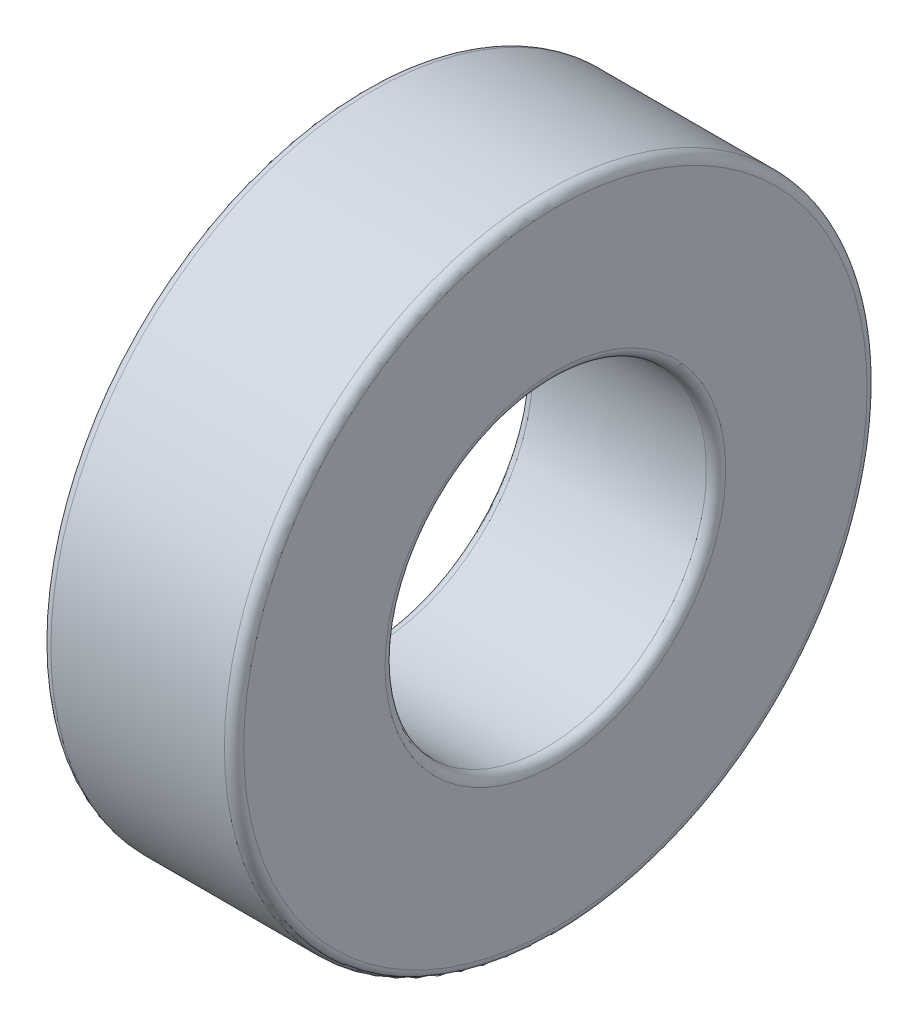
ISO-10303-21;
HEADER;
FILE_DESCRIPTION(('STEP AP214'),'2;1');
FILE_NAME('part.step','',(''),(''),'','','');
FILE_SCHEMA(('AUTOMOTIVE_DESIGN { 1 0 10303 214 1 1 1 1 }'));
ENDSEC;
DATA;
#1=APPLICATION_CONTEXT('core data for automotive mechanical design processes');
#2=APPLICATION_PROTOCOL_DEFINITION('international standard','automotive_design',2000,#1);
#3=PRODUCT_CONTEXT('',#1,'mechanical');
#4=PRODUCT('Part','Part','',(#3));
#5=PRODUCT_RELATED_PRODUCT_CATEGORY('part','',(#4));
#6=PRODUCT_DEFINITION_FORMATION('','',#4);
#7=PRODUCT_DEFINITION_CONTEXT('part definition',#1,'design');
#8=PRODUCT_DEFINITION('design','',#6,#7);
#9=PRODUCT_DEFINITION_SHAPE('','',#8);
#10=(LENGTH_UNIT() NAMED_UNIT(*) SI_UNIT(.MILLI.,.METRE.));
#11=(NAMED_UNIT(*) PLANE_ANGLE_UNIT() SI_UNIT($,.RADIAN.));
#12=(NAMED_UNIT(*) SI_UNIT($,.STERADIAN.) SOLID_ANGLE_UNIT());
#13=UNCERTAINTY_MEASURE_WITH_UNIT(LENGTH_MEASURE(1.E-05),#10,'distance_accuracy_value','');
#14=(GEOMETRIC_REPRESENTATION_CONTEXT(3) GLOBAL_UNCERTAINTY_ASSIGNED_CONTEXT((#13)) GLOBAL_UNIT_ASSIGNED_CONTEXT((#10,
#11,#12)) REPRESENTATION_CONTEXT('',''));
#15=CARTESIAN_POINT('',(0.,0.,0.));
#16=DIRECTION('',(0.,0.,1.));
#17=DIRECTION('',(1.,0.,0.));
#18=AXIS2_PLACEMENT_3D('',#15,#16,#17);
#19=CARTESIAN_POINT('',(0.15,0.,0.));
#20=DIRECTION('',(-1.,0.,0.));
#21=DIRECTION('',(0.,0.,1.));
#22=AXIS2_PLACEMENT_3D('',#19,#20,#21);
#23=CYLINDRICAL_SURFACE('',#22,2.5);
#24=CARTESIAN_POINT('',(2.85,0.,0.));
#25=DIRECTION('',(-1.,0.,0.));
#26=DIRECTION('',(0.,0.,1.));
#27=AXIS2_PLACEMENT_3D('',#24,#25,#26);
#28=CIRCLE('',#27,2.5);
#29=CARTESIAN_POINT('',(2.85,0.,2.5));
#30=VERTEX_POINT('',#29);
#31=EDGE_CURVE('E10',#30,#30,#28,.T.);
#32=ORIENTED_EDGE('',*,*,#31,.F.);
#33=EDGE_LOOP('',(#32));
#34=FACE_BOUND('',#33,.T.);
#35=CARTESIAN_POINT('',(0.15,0.,0.));
#36=DIRECTION('',(-1.,0.,0.));
#37=DIRECTION('',(0.,0.,1.));
#38=AXIS2_PLACEMENT_3D('',#35,#36,#37);
#39=CIRCLE('',#38,2.5);
#40=CARTESIAN_POINT('',(0.15,0.,2.5));
#41=VERTEX_POINT('',#40);
#42=EDGE_CURVE('E82',#41,#41,#39,.T.);
#43=ORIENTED_EDGE('',*,*,#42,.T.);
#44=EDGE_LOOP('',(#43));
#45=FACE_BOUND('',#44,.T.);
#46=ADVANCED_FACE('F15',(#34,#45),#23,.F.);
#47=CARTESIAN_POINT('',(2.85,0.,0.));
#48=DIRECTION('',(-1.,0.,0.));
#49=DIRECTION('',(0.,0.,1.));
#50=AXIS2_PLACEMENT_3D('',#47,#48,#49);
#51=TOROIDAL_SURFACE('',#50,2.65,0.15);
#52=CARTESIAN_POINT('',(3.,0.,0.));
#53=DIRECTION('',(-1.,0.,0.));
#54=DIRECTION('',(0.,0.,1.));
#55=AXIS2_PLACEMENT_3D('',#52,#53,#54);
#56=CIRCLE('',#55,2.65);
#57=CARTESIAN_POINT('',(3.,0.,2.65));
#58=VERTEX_POINT('',#57);
#59=EDGE_CURVE('E24',#58,#58,#56,.T.);
#60=ORIENTED_EDGE('',*,*,#59,.F.);
#61=EDGE_LOOP('',(#60));
#62=FACE_BOUND('',#61,.T.);
#63=ORIENTED_EDGE('',*,*,#31,.T.);
#64=EDGE_LOOP('',(#63));
#65=FACE_BOUND('',#64,.T.);
#66=ADVANCED_FACE('F110',(#62,#65),#51,.T.);
#67=CARTESIAN_POINT('',(3.,2.65,0.));
#68=DIRECTION('',(-1.,0.,0.));
#69=DIRECTION('',(0.,0.,1.));
#70=AXIS2_PLACEMENT_3D('',#67,#68,#69);
#71=PLANE('',#70);
#72=CARTESIAN_POINT('',(3.,0.,0.));
#73=DIRECTION('',(-1.,0.,0.));
#74=DIRECTION('',(0.,0.,1.));
#75=AXIS2_PLACEMENT_3D('',#72,#73,#74);
#76=CIRCLE('',#75,4.85);
#77=CARTESIAN_POINT('',(3.,0.,4.85));
#78=VERTEX_POINT('',#77);
#79=EDGE_CURVE('E33',#78,#78,#76,.T.);
#80=ORIENTED_EDGE('',*,*,#79,.F.);
#81=EDGE_LOOP('',(#80));
#82=FACE_BOUND('',#81,.T.);
#83=ORIENTED_EDGE('',*,*,#59,.T.);
#84=EDGE_LOOP('',(#83));
#85=FACE_BOUND('',#84,.T.);
#86=ADVANCED_FACE('F107',(#82,#85),#71,.F.);
#87=CARTESIAN_POINT('',(2.85,0.,0.));
#88=DIRECTION('',(-1.,0.,0.));
#89=DIRECTION('',(0.,0.,1.));
#90=AXIS2_PLACEMENT_3D('',#87,#88,#89);
#91=TOROIDAL_SURFACE('',#90,4.85,0.15);
#92=CARTESIAN_POINT('',(2.85,0.,0.));
#93=DIRECTION('',(-1.,0.,0.));
#94=DIRECTION('',(0.,0.,1.));
#95=AXIS2_PLACEMENT_3D('',#92,#93,#94);
#96=CIRCLE('',#95,5.);
#97=CARTESIAN_POINT('',(2.85,0.,5.));
#98=VERTEX_POINT('',#97);
#99=EDGE_CURVE('E97',#98,#98,#96,.T.);
#100=ORIENTED_EDGE('',*,*,#99,.F.);
#101=EDGE_LOOP('',(#100));
#102=FACE_BOUND('',#101,.T.);
#103=ORIENTED_EDGE('',*,*,#79,.T.);
#104=EDGE_LOOP('',(#103));
#105=FACE_BOUND('',#104,.T.);
#106=ADVANCED_FACE('F105',(#102,#105),#91,.T.);
#107=CARTESIAN_POINT('',(0.15,0.,0.));
#108=DIRECTION('',(-1.,0.,0.));
#109=DIRECTION('',(0.,0.,1.));
#110=AXIS2_PLACEMENT_3D('',#107,#108,#109);
#111=CYLINDRICAL_SURFACE('',#110,5.);
#112=CARTESIAN_POINT('',(0.15,0.,0.));
#113=DIRECTION('',(-1.,0.,0.));
#114=DIRECTION('',(0.,0.,1.));
#115=AXIS2_PLACEMENT_3D('',#112,#113,#114);
#116=CIRCLE('',#115,5.);
#117=CARTESIAN_POINT('',(0.15,0.,5.));
#118=VERTEX_POINT('',#117);
#119=EDGE_CURVE('E93',#118,#118,#116,.T.);
#120=ORIENTED_EDGE('',*,*,#119,.F.);
#121=EDGE_LOOP('',(#120));
#122=FACE_BOUND('',#121,.T.);
#123=ORIENTED_EDGE('',*,*,#99,.T.);
#124=EDGE_LOOP('',(#123));
#125=FACE_BOUND('',#124,.T.);
#126=ADVANCED_FACE('F123',(#122,#125),#111,.T.);
#127=CARTESIAN_POINT('',(0.15,0.,0.));
#128=DIRECTION('',(-1.,0.,0.));
#129=DIRECTION('',(0.,0.,1.));
#130=AXIS2_PLACEMENT_3D('',#127,#128,#129);
#131=TOROIDAL_SURFACE('',#130,4.85,0.15);
#132=CARTESIAN_POINT('',(0.,0.,0.));
#133=DIRECTION('',(-1.,0.,0.));
#134=DIRECTION('',(0.,0.,1.));
#135=AXIS2_PLACEMENT_3D('',#132,#133,#134);
#136=CIRCLE('',#135,4.85);
#137=CARTESIAN_POINT('',(0.,0.,4.85));
#138=VERTEX_POINT('',#137);
#139=EDGE_CURVE('E89',#138,#138,#136,.T.);
#140=ORIENTED_EDGE('',*,*,#139,.F.);
#141=EDGE_LOOP('',(#140));
#142=FACE_BOUND('',#141,.T.);
#143=ORIENTED_EDGE('',*,*,#119,.T.);
#144=EDGE_LOOP('',(#143));
#145=FACE_BOUND('',#144,.T.);
#146=ADVANCED_FACE('F127',(#142,#145),#131,.T.);
#147=CARTESIAN_POINT('',(0.,2.65,0.));
#148=DIRECTION('',(-1.,0.,0.));
#149=DIRECTION('',(0.,0.,1.));
#150=AXIS2_PLACEMENT_3D('',#147,#148,#149);
#151=PLANE('',#150);
#152=ORIENTED_EDGE('',*,*,#139,.T.);
#153=EDGE_LOOP('',(#152));
#154=FACE_BOUND('',#153,.T.);
#155=CARTESIAN_POINT('',(0.,0.,0.));
#156=DIRECTION('',(-1.,0.,0.));
#157=DIRECTION('',(0.,0.,1.));
#158=AXIS2_PLACEMENT_3D('',#155,#156,#157);
#159=CIRCLE('',#158,2.65);
#160=CARTESIAN_POINT('',(0.,0.,2.65));
#161=VERTEX_POINT('',#160);
#162=EDGE_CURVE('E85',#161,#161,#159,.T.);
#163=ORIENTED_EDGE('',*,*,#162,.F.);
#164=EDGE_LOOP('',(#163));
#165=FACE_BOUND('',#164,.T.);
#166=ADVANCED_FACE('F131',(#154,#165),#151,.T.);
#167=CARTESIAN_POINT('',(0.15,0.,0.));
#168=DIRECTION('',(-1.,0.,0.));
#169=DIRECTION('',(0.,0.,1.));
#170=AXIS2_PLACEMENT_3D('',#167,#168,#169);
#171=TOROIDAL_SURFACE('',#170,2.65,0.15);
#172=ORIENTED_EDGE('',*,*,#42,.F.);
#173=EDGE_LOOP('',(#172));
#174=FACE_BOUND('',#173,.T.);
#175=ORIENTED_EDGE('',*,*,#162,.T.);
#176=EDGE_LOOP('',(#175));
#177=FACE_BOUND('',#176,.T.);
#178=ADVANCED_FACE('F135',(#174,#177),#171,.T.);
#179=CLOSED_SHELL('',(#46,#66,#86,#106,#126,#146,#166,#178));
#180=CARTESIAN_POINT('',(0.5625,0.,0.));
#181=DIRECTION('',(-1.,0.,0.));
#182=DIRECTION('',(0.,0.,-1.));
#183=AXIS2_PLACEMENT_3D('',#180,#181,#182);
#184=CYLINDRICAL_SURFACE('',#183,3.6825);
#185=CARTESIAN_POINT('',(1.4325,0.,0.));
#186=DIRECTION('',(-1.,0.,0.));
#187=DIRECTION('',(0.,-1.,0.));
#188=AXIS2_PLACEMENT_3D('',#185,#186,#187);
#189=CIRCLE('',#188,3.6825);
#190=CARTESIAN_POINT('',(1.4325,-3.6825,0.));
#191=VERTEX_POINT('',#190);
#192=EDGE_CURVE('E63',#191,#191,#189,.T.);
#193=ORIENTED_EDGE('',*,*,#192,.T.);
#194=EDGE_LOOP('',(#193));
#195=FACE_BOUND('',#194,.T.);
#196=CARTESIAN_POINT('',(0.5625,0.,0.));
#197=DIRECTION('',(-1.,0.,0.));
#198=DIRECTION('',(0.,0.,-1.));
#199=AXIS2_PLACEMENT_3D('',#196,#197,#198);
#200=CIRCLE('',#199,3.6825);
#201=CARTESIAN_POINT('',(0.5625,0.,-3.6825));
#202=VERTEX_POINT('',#201);
#203=EDGE_CURVE('E78',#202,#202,#200,.T.);
#204=ORIENTED_EDGE('',*,*,#203,.F.);
#205=EDGE_LOOP('',(#204));
#206=FACE_BOUND('',#205,.T.);
#207=ADVANCED_FACE('F146',(#195,#206),#184,.T.);
#208=CARTESIAN_POINT('',(0.5625,0.,0.));
#209=DIRECTION('',(-1.,0.,0.));
#210=DIRECTION('',(0.,0.,-1.));
#211=AXIS2_PLACEMENT_3D('',#208,#209,#210);
#212=CYLINDRICAL_SURFACE('',#211,3.8175);
#213=CARTESIAN_POINT('',(1.4325,0.,0.));
#214=DIRECTION('',(-1.,0.,0.));
#215=DIRECTION('',(0.,-1.,0.));
#216=AXIS2_PLACEMENT_3D('',#213,#214,#215);
#217=CIRCLE('',#216,3.8175);
#218=CARTESIAN_POINT('',(1.4325,-3.8175,0.));
#219=VERTEX_POINT('',#218);
#220=EDGE_CURVE('E18',#219,#219,#217,.F.);
#221=ORIENTED_EDGE('',*,*,#220,.T.);
#222=EDGE_LOOP('',(#221));
#223=FACE_BOUND('',#222,.T.);
#224=CARTESIAN_POINT('',(0.5625,0.,0.));
#225=DIRECTION('',(-1.,0.,0.));
#226=DIRECTION('',(0.,0.,-1.));
#227=AXIS2_PLACEMENT_3D('',#224,#225,#226);
#228=CIRCLE('',#227,3.8175);
#229=CARTESIAN_POINT('',(0.5625,0.,-3.8175));
#230=VERTEX_POINT('',#229);
#231=EDGE_CURVE('E74',#230,#230,#228,.T.);
#232=ORIENTED_EDGE('',*,*,#231,.T.);
#233=EDGE_LOOP('',(#232));
#234=FACE_BOUND('',#233,.T.);
#235=ADVANCED_FACE('F152',(#223,#234),#212,.F.);
#236=CARTESIAN_POINT('',(0.5625,-3.6825,0.));
#237=DIRECTION('',(-1.,0.,0.));
#238=DIRECTION('',(0.,0.,-1.));
#239=AXIS2_PLACEMENT_3D('',#236,#237,#238);
#240=PLANE('',#239);
#241=ORIENTED_EDGE('',*,*,#231,.F.);
#242=EDGE_LOOP('',(#241));
#243=FACE_BOUND('',#242,.T.);
#244=ORIENTED_EDGE('',*,*,#203,.T.);
#245=EDGE_LOOP('',(#244));
#246=FACE_BOUND('',#245,.T.);
#247=ADVANCED_FACE('F148',(#243,#246),#240,.F.);
#248=CARTESIAN_POINT('',(1.4325,-3.33333333333333,0.));
#249=DIRECTION('',(-1.,0.,0.));
#250=DIRECTION('',(0.,0.,-1.));
#251=AXIS2_PLACEMENT_3D('',#248,#249,#250);
#252=PLANE('',#251);
#253=CARTESIAN_POINT('',(1.4325,0.,0.));
#254=DIRECTION('',(-1.,0.,0.));
#255=DIRECTION('',(0.,0.,-1.));
#256=AXIS2_PLACEMENT_3D('',#253,#254,#255);
#257=CIRCLE('',#256,4.16666666666667);
#258=CARTESIAN_POINT('',(1.4325,0.,-4.16666666666667));
#259=VERTEX_POINT('',#258);
#260=EDGE_CURVE('E50',#259,#259,#257,.T.);
#261=ORIENTED_EDGE('',*,*,#260,.F.);
#262=EDGE_LOOP('',(#261));
#263=FACE_BOUND('',#262,.T.);
#264=ORIENTED_EDGE('',*,*,#220,.F.);
#265=EDGE_LOOP('',(#264));
#266=FACE_BOUND('',#265,.T.);
#267=ADVANCED_FACE('F151',(#263,#266),#252,.F.);
#268=CARTESIAN_POINT('',(1.4325,0.,0.));
#269=DIRECTION('',(-1.,0.,0.));
#270=DIRECTION('',(0.,0.,-1.));
#271=AXIS2_PLACEMENT_3D('',#268,#269,#270);
#272=CYLINDRICAL_SURFACE('',#271,4.16666666666667);
#273=CARTESIAN_POINT('',(1.5675,0.,0.));
#274=DIRECTION('',(-1.,0.,0.));
#275=DIRECTION('',(0.,0.,-1.));
#276=AXIS2_PLACEMENT_3D('',#273,#274,#275);
#277=CIRCLE('',#276,4.16666666666667);
#278=CARTESIAN_POINT('',(1.5675,0.,-4.16666666666667));
#279=VERTEX_POINT('',#278);
#280=EDGE_CURVE('E59',#279,#279,#277,.T.);
#281=ORIENTED_EDGE('',*,*,#280,.F.);
#282=EDGE_LOOP('',(#281));
#283=FACE_BOUND('',#282,.T.);
#284=ORIENTED_EDGE('',*,*,#260,.T.);
#285=EDGE_LOOP('',(#284));
#286=FACE_BOUND('',#285,.T.);
#287=ADVANCED_FACE('F168',(#283,#286),#272,.F.);
#288=CARTESIAN_POINT('',(1.5675,-4.16666666666667,0.));
#289=DIRECTION('',(1.,0.,0.));
#290=DIRECTION('',(0.,0.,1.));
#291=AXIS2_PLACEMENT_3D('',#288,#289,#290);
#292=PLANE('',#291);
#293=ORIENTED_EDGE('',*,*,#280,.T.);
#294=EDGE_LOOP('',(#293));
#295=FACE_BOUND('',#294,.T.);
#296=CARTESIAN_POINT('',(1.5675,0.,0.));
#297=DIRECTION('',(1.,0.,0.));
#298=DIRECTION('',(0.,1.,0.));
#299=AXIS2_PLACEMENT_3D('',#296,#297,#298);
#300=CIRCLE('',#299,3.8175);
#301=CARTESIAN_POINT('',(1.5675,3.8175,0.));
#302=VERTEX_POINT('',#301);
#303=EDGE_CURVE('E36',#302,#302,#300,.F.);
#304=ORIENTED_EDGE('',*,*,#303,.F.);
#305=EDGE_LOOP('',(#304));
#306=FACE_BOUND('',#305,.T.);
#307=ADVANCED_FACE('F167',(#295,#306),#292,.F.);
#308=CARTESIAN_POINT('',(1.4325,0.,0.));
#309=DIRECTION('',(-1.,0.,0.));
#310=DIRECTION('',(0.,0.,-1.));
#311=AXIS2_PLACEMENT_3D('',#308,#309,#310);
#312=CIRCLE('',#311,3.33333333333333);
#313=CARTESIAN_POINT('',(1.4325,0.,-3.33333333333333));
#314=VERTEX_POINT('',#313);
#315=EDGE_CURVE('E40',#314,#314,#312,.T.);
#316=ORIENTED_EDGE('',*,*,#315,.T.);
#317=EDGE_LOOP('',(#316));
#318=FACE_BOUND('',#317,.T.);
#319=ORIENTED_EDGE('',*,*,#192,.F.);
#320=EDGE_LOOP('',(#319));
#321=FACE_BOUND('',#320,.T.);
#322=ADVANCED_FACE('F164',(#318,#321),#252,.F.);
#323=CARTESIAN_POINT('',(1.5675,0.,0.));
#324=DIRECTION('',(-1.,0.,0.));
#325=DIRECTION('',(0.,0.,-1.));
#326=AXIS2_PLACEMENT_3D('',#323,#324,#325);
#327=CIRCLE('',#326,3.33333333333333);
#328=CARTESIAN_POINT('',(1.5675,0.,-3.33333333333333));
#329=VERTEX_POINT('',#328);
#330=EDGE_CURVE('E208',#329,#329,#327,.T.);
#331=ORIENTED_EDGE('',*,*,#330,.F.);
#332=EDGE_LOOP('',(#331));
#333=FACE_BOUND('',#332,.T.);
#334=CARTESIAN_POINT('',(1.5675,0.,0.));
#335=DIRECTION('',(1.,0.,0.));
#336=DIRECTION('',(0.,1.,0.));
#337=AXIS2_PLACEMENT_3D('',#334,#335,#336);
#338=CIRCLE('',#337,3.6825);
#339=CARTESIAN_POINT('',(1.5675,3.6825,0.));
#340=VERTEX_POINT('',#339);
#341=EDGE_CURVE('E39',#340,#340,#338,.T.);
#342=ORIENTED_EDGE('',*,*,#341,.F.);
#343=EDGE_LOOP('',(#342));
#344=FACE_BOUND('',#343,.T.);
#345=ADVANCED_FACE('F162',(#333,#344),#292,.F.);
#346=CARTESIAN_POINT('',(1.4325,0.,0.));
#347=DIRECTION('',(-1.,0.,0.));
#348=DIRECTION('',(0.,0.,-1.));
#349=AXIS2_PLACEMENT_3D('',#346,#347,#348);
#350=CYLINDRICAL_SURFACE('',#349,3.33333333333333);
#351=ORIENTED_EDGE('',*,*,#315,.F.);
#352=EDGE_LOOP('',(#351));
#353=FACE_BOUND('',#352,.T.);
#354=ORIENTED_EDGE('',*,*,#330,.T.);
#355=EDGE_LOOP('',(#354));
#356=FACE_BOUND('',#355,.T.);
#357=ADVANCED_FACE('F144',(#353,#356),#350,.T.);
#358=ORIENTED_EDGE('',*,*,#341,.T.);
#359=EDGE_LOOP('',(#358));
#360=FACE_BOUND('',#359,.T.);
#361=CARTESIAN_POINT('',(2.4375,0.,0.));
#362=DIRECTION('',(-1.,0.,0.));
#363=DIRECTION('',(0.,0.,-1.));
#364=AXIS2_PLACEMENT_3D('',#361,#362,#363);
#365=CIRCLE('',#364,3.6825);
#366=CARTESIAN_POINT('',(2.4375,0.,-3.6825));
#367=VERTEX_POINT('',#366);
#368=EDGE_CURVE('E66',#367,#367,#365,.T.);
#369=ORIENTED_EDGE('',*,*,#368,.T.);
#370=EDGE_LOOP('',(#369));
#371=FACE_BOUND('',#370,.T.);
#372=ADVANCED_FACE('F140',(#360,#371),#184,.T.);
#373=CARTESIAN_POINT('',(2.4375,-3.8175,0.));
#374=DIRECTION('',(1.,0.,0.));
#375=DIRECTION('',(0.,0.,1.));
#376=AXIS2_PLACEMENT_3D('',#373,#374,#375);
#377=PLANE('',#376);
#378=ORIENTED_EDGE('',*,*,#368,.F.);
#379=EDGE_LOOP('',(#378));
#380=FACE_BOUND('',#379,.T.);
#381=CARTESIAN_POINT('',(2.4375,0.,0.));
#382=DIRECTION('',(-1.,0.,0.));
#383=DIRECTION('',(0.,0.,-1.));
#384=AXIS2_PLACEMENT_3D('',#381,#382,#383);
#385=CIRCLE('',#384,3.8175);
#386=CARTESIAN_POINT('',(2.4375,0.,-3.8175));
#387=VERTEX_POINT('',#386);
#388=EDGE_CURVE('E70',#387,#387,#385,.T.);
#389=ORIENTED_EDGE('',*,*,#388,.T.);
#390=EDGE_LOOP('',(#389));
#391=FACE_BOUND('',#390,.T.);
#392=ADVANCED_FACE('F143',(#380,#391),#377,.F.);
#393=ORIENTED_EDGE('',*,*,#303,.T.);
#394=EDGE_LOOP('',(#393));
#395=FACE_BOUND('',#394,.T.);
#396=ORIENTED_EDGE('',*,*,#388,.F.);
#397=EDGE_LOOP('',(#396));
#398=FACE_BOUND('',#397,.T.);
#399=ADVANCED_FACE('F154',(#395,#398),#212,.F.);
#400=CLOSED_SHELL('',(#207,#235,#247,#267,#287,#307,#322,#345,#357,#372,#392,#399));
#401=ORIENTED_CLOSED_SHELL('',*,#400,.T.);
#402=BREP_WITH_VOIDS('B1',#179,(#401));
#403=ADVANCED_BREP_SHAPE_REPRESENTATION('',(#18,#402),#14);
#404=SHAPE_DEFINITION_REPRESENTATION(#9,#403);
ENDSEC;
END-ISO-10303-21;
